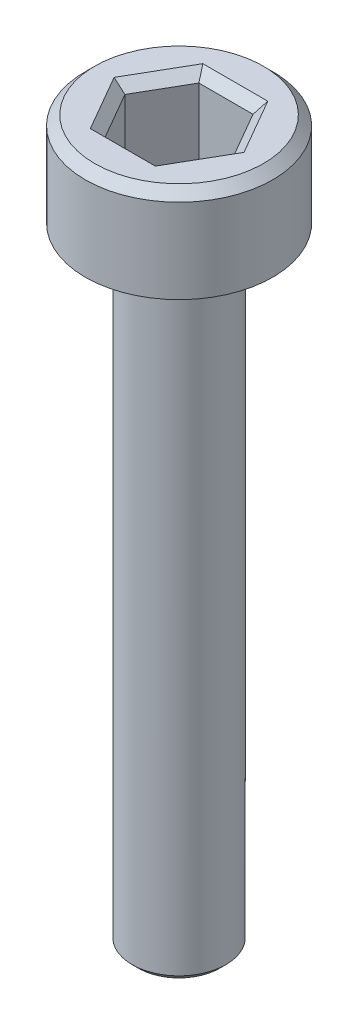
ISO-10303-21;
HEADER;
FILE_DESCRIPTION(('STEP AP214'),'2;1');
FILE_NAME('part.step','',(''),(''),'','','');
FILE_SCHEMA(('AUTOMOTIVE_DESIGN { 1 0 10303 214 1 1 1 1 }'));
ENDSEC;
DATA;
#1=APPLICATION_CONTEXT('core data for automotive mechanical design processes');
#2=APPLICATION_PROTOCOL_DEFINITION('international standard','automotive_design',2000,#1);
#3=PRODUCT_CONTEXT('',#1,'mechanical');
#4=PRODUCT('Part','Part','',(#3));
#5=PRODUCT_RELATED_PRODUCT_CATEGORY('part','',(#4));
#6=PRODUCT_DEFINITION_FORMATION('','',#4);
#7=PRODUCT_DEFINITION_CONTEXT('part definition',#1,'design');
#8=PRODUCT_DEFINITION('design','',#6,#7);
#9=PRODUCT_DEFINITION_SHAPE('','',#8);
#10=(LENGTH_UNIT() NAMED_UNIT(*) SI_UNIT(.MILLI.,.METRE.));
#11=(NAMED_UNIT(*) PLANE_ANGLE_UNIT() SI_UNIT($,.RADIAN.));
#12=(NAMED_UNIT(*) SI_UNIT($,.STERADIAN.) SOLID_ANGLE_UNIT());
#13=UNCERTAINTY_MEASURE_WITH_UNIT(LENGTH_MEASURE(1.E-05),#10,'distance_accuracy_value','');
#14=(GEOMETRIC_REPRESENTATION_CONTEXT(3) GLOBAL_UNCERTAINTY_ASSIGNED_CONTEXT((#13)) GLOBAL_UNIT_ASSIGNED_CONTEXT((#10,
#11,#12)) REPRESENTATION_CONTEXT('',''));
#15=CARTESIAN_POINT('',(0.,0.,0.));
#16=DIRECTION('',(0.,0.,1.));
#17=DIRECTION('',(1.,0.,0.));
#18=AXIS2_PLACEMENT_3D('',#15,#16,#17);
#19=CARTESIAN_POINT('',(0.,0.,0.));
#20=DIRECTION('',(0.,1.,0.));
#21=DIRECTION('',(0.,0.,1.));
#22=AXIS2_PLACEMENT_3D('',#19,#20,#21);
#23=PLANE('',#22);
#24=CARTESIAN_POINT('',(0.,0.,0.));
#25=DIRECTION('',(0.,1.,0.));
#26=DIRECTION('',(0.,0.,1.));
#27=AXIS2_PLACEMENT_3D('',#24,#25,#26);
#28=CIRCLE('',#27,3.);
#29=CARTESIAN_POINT('',(0.,0.,3.));
#30=VERTEX_POINT('',#29);
#31=EDGE_CURVE('E146',#30,#30,#28,.T.);
#32=ORIENTED_EDGE('',*,*,#31,.F.);
#33=EDGE_LOOP('',(#32));
#34=FACE_BOUND('',#33,.T.);
#35=CARTESIAN_POINT('',(0.,0.,0.));
#36=DIRECTION('',(0.,1.,0.));
#37=DIRECTION('',(0.,0.,1.));
#38=AXIS2_PLACEMENT_3D('',#35,#36,#37);
#39=CIRCLE('',#38,1.5);
#40=CARTESIAN_POINT('',(0.,0.,1.5));
#41=VERTEX_POINT('',#40);
#42=EDGE_CURVE('E185',#41,#41,#39,.F.);
#43=ORIENTED_EDGE('',*,*,#42,.F.);
#44=EDGE_LOOP('',(#43));
#45=FACE_BOUND('',#44,.T.);
#46=ADVANCED_FACE('F33',(#34,#45),#23,.F.);
#47=CARTESIAN_POINT('',(0.,3.,0.));
#48=DIRECTION('',(0.,-1.,0.));
#49=DIRECTION('',(0.,0.,-1.));
#50=AXIS2_PLACEMENT_3D('',#47,#48,#49);
#51=CYLINDRICAL_SURFACE('',#50,3.);
#52=CARTESIAN_POINT('',(0.,2.7,0.));
#53=DIRECTION('',(0.,1.,0.));
#54=DIRECTION('',(0.,0.,1.));
#55=AXIS2_PLACEMENT_3D('',#52,#53,#54);
#56=CIRCLE('',#55,3.);
#57=CARTESIAN_POINT('',(0.,2.7,3.));
#58=VERTEX_POINT('',#57);
#59=EDGE_CURVE('E160',#58,#58,#56,.F.);
#60=ORIENTED_EDGE('',*,*,#59,.T.);
#61=EDGE_LOOP('',(#60));
#62=FACE_BOUND('',#61,.T.);
#63=ORIENTED_EDGE('',*,*,#31,.T.);
#64=EDGE_LOOP('',(#63));
#65=FACE_BOUND('',#64,.T.);
#66=ADVANCED_FACE('F213',(#62,#65),#51,.T.);
#67=CARTESIAN_POINT('',(0.,3.,0.));
#68=DIRECTION('',(0.,1.,0.));
#69=DIRECTION('',(0.,0.,1.));
#70=AXIS2_PLACEMENT_3D('',#67,#68,#69);
#71=PLANE('',#70);
#72=DIRECTION('',(1.,0.,0.));
#73=VECTOR('',#72,1.);
#74=CARTESIAN_POINT('',(0.866025403784439,3.,-1.8));
#75=LINE('',#74,#73);
#76=CARTESIAN_POINT('',(-1.03923048454133,3.,-1.8));
#77=VERTEX_POINT('',#76);
#78=CARTESIAN_POINT('',(1.03923048454133,3.,-1.8));
#79=VERTEX_POINT('',#78);
#80=EDGE_CURVE('E165',#77,#79,#75,.T.);
#81=ORIENTED_EDGE('',*,*,#80,.T.);
#82=DIRECTION('',(0.5,0.,0.866025403784439));
#83=VECTOR('',#82,1.);
#84=CARTESIAN_POINT('',(1.99185842870421,3.,-0.150000000000001));
#85=LINE('',#84,#83);
#86=CARTESIAN_POINT('',(2.07846096908265,3.,0.));
#87=VERTEX_POINT('',#86);
#88=EDGE_CURVE('E175',#79,#87,#85,.T.);
#89=ORIENTED_EDGE('',*,*,#88,.T.);
#90=DIRECTION('',(-0.5,0.,0.866025403784439));
#91=VECTOR('',#90,1.);
#92=CARTESIAN_POINT('',(1.12583302491977,3.,1.65));
#93=LINE('',#92,#91);
#94=CARTESIAN_POINT('',(1.03923048454133,3.,1.8));
#95=VERTEX_POINT('',#94);
#96=EDGE_CURVE('E173',#87,#95,#93,.T.);
#97=ORIENTED_EDGE('',*,*,#96,.T.);
#98=DIRECTION('',(-1.,0.,0.));
#99=VECTOR('',#98,1.);
#100=CARTESIAN_POINT('',(-0.866025403784438,3.,1.8));
#101=LINE('',#100,#99);
#102=CARTESIAN_POINT('',(-1.03923048454133,3.,1.8));
#103=VERTEX_POINT('',#102);
#104=EDGE_CURVE('E171',#95,#103,#101,.T.);
#105=ORIENTED_EDGE('',*,*,#104,.T.);
#106=DIRECTION('',(-0.5,0.,-0.866025403784439));
#107=VECTOR('',#106,1.);
#108=CARTESIAN_POINT('',(-1.99185842870421,3.,0.150000000000001));
#109=LINE('',#108,#107);
#110=CARTESIAN_POINT('',(-2.07846096908265,3.,0.));
#111=VERTEX_POINT('',#110);
#112=EDGE_CURVE('E169',#103,#111,#109,.T.);
#113=ORIENTED_EDGE('',*,*,#112,.T.);
#114=DIRECTION('',(0.5,0.,-0.866025403784439));
#115=VECTOR('',#114,1.);
#116=CARTESIAN_POINT('',(-1.12583302491977,3.,-1.65));
#117=LINE('',#116,#115);
#118=EDGE_CURVE('E167',#111,#77,#117,.T.);
#119=ORIENTED_EDGE('',*,*,#118,.T.);
#120=EDGE_LOOP('',(#81,#89,#97,#105,#113,#119));
#121=FACE_BOUND('',#120,.T.);
#122=CARTESIAN_POINT('',(0.,3.,0.));
#123=DIRECTION('',(0.,1.,0.));
#124=DIRECTION('',(0.,0.,1.));
#125=AXIS2_PLACEMENT_3D('',#122,#123,#124);
#126=CIRCLE('',#125,2.7);
#127=CARTESIAN_POINT('',(0.,3.,2.7));
#128=VERTEX_POINT('',#127);
#129=EDGE_CURVE('E157',#128,#128,#126,.T.);
#130=ORIENTED_EDGE('',*,*,#129,.T.);
#131=EDGE_LOOP('',(#130));
#132=FACE_BOUND('',#131,.T.);
#133=ADVANCED_FACE('F219',(#121,#132),#71,.T.);
#134=CARTESIAN_POINT('',(0.,3.,0.));
#135=DIRECTION('',(0.,-1.,0.));
#136=DIRECTION('',(0.,0.,-1.));
#137=AXIS2_PLACEMENT_3D('',#134,#135,#136);
#138=CONICAL_SURFACE('',#137,2.7,0.785398163397448);
#139=ORIENTED_EDGE('',*,*,#59,.F.);
#140=EDGE_LOOP('',(#139));
#141=FACE_BOUND('',#140,.T.);
#142=ORIENTED_EDGE('',*,*,#129,.F.);
#143=EDGE_LOOP('',(#142));
#144=FACE_BOUND('',#143,.T.);
#145=ADVANCED_FACE('F227',(#141,#144),#138,.T.);
#146=CARTESIAN_POINT('',(0.866025403784439,0.5,1.5));
#147=DIRECTION('',(0.866025403784439,0.,0.5));
#148=DIRECTION('',(0.5,0.,-0.866025403784439));
#149=AXIS2_PLACEMENT_3D('',#146,#147,#148);
#150=PLANE('',#149);
#151=DIRECTION('',(0.,1.,0.));
#152=VECTOR('',#151,1.);
#153=CARTESIAN_POINT('',(0.866025403784439,0.5,1.5));
#154=LINE('',#153,#152);
#155=CARTESIAN_POINT('',(0.866025403784439,0.5,1.5));
#156=VERTEX_POINT('',#155);
#157=CARTESIAN_POINT('',(0.866025403784439,2.7,1.5));
#158=VERTEX_POINT('',#157);
#159=EDGE_CURVE('E144',#156,#158,#154,.T.);
#160=ORIENTED_EDGE('',*,*,#159,.T.);
#161=DIRECTION('',(0.5,0.,-0.866025403784439));
#162=VECTOR('',#161,1.);
#163=CARTESIAN_POINT('',(1.73205080756888,2.7,0.));
#164=LINE('',#163,#162);
#165=CARTESIAN_POINT('',(1.73205080756888,2.7,0.));
#166=VERTEX_POINT('',#165);
#167=EDGE_CURVE('E113',#158,#166,#164,.T.);
#168=ORIENTED_EDGE('',*,*,#167,.T.);
#169=DIRECTION('',(0.,1.,0.));
#170=VECTOR('',#169,1.);
#171=CARTESIAN_POINT('',(1.73205080756888,0.5,0.));
#172=LINE('',#171,#170);
#173=CARTESIAN_POINT('',(1.73205080756888,0.5,0.));
#174=VERTEX_POINT('',#173);
#175=EDGE_CURVE('E105',#174,#166,#172,.T.);
#176=ORIENTED_EDGE('',*,*,#175,.F.);
#177=DIRECTION('',(0.5,0.,-0.866025403784439));
#178=VECTOR('',#177,1.);
#179=CARTESIAN_POINT('',(0.866025403784439,0.5,1.5));
#180=LINE('',#179,#178);
#181=EDGE_CURVE('E110',#156,#174,#180,.T.);
#182=ORIENTED_EDGE('',*,*,#181,.F.);
#183=EDGE_LOOP('',(#160,#168,#176,#182));
#184=FACE_BOUND('',#183,.T.);
#185=ADVANCED_FACE('F108',(#184),#150,.F.);
#186=CARTESIAN_POINT('',(-0.866025403784438,0.5,1.5));
#187=DIRECTION('',(0.,0.,1.));
#188=DIRECTION('',(1.,0.,0.));
#189=AXIS2_PLACEMENT_3D('',#186,#187,#188);
#190=PLANE('',#189);
#191=DIRECTION('',(0.,1.,0.));
#192=VECTOR('',#191,1.);
#193=CARTESIAN_POINT('',(-0.866025403784438,0.5,1.5));
#194=LINE('',#193,#192);
#195=CARTESIAN_POINT('',(-0.866025403784438,0.5,1.5));
#196=VERTEX_POINT('',#195);
#197=CARTESIAN_POINT('',(-0.866025403784438,2.7,1.5));
#198=VERTEX_POINT('',#197);
#199=EDGE_CURVE('E147',#196,#198,#194,.T.);
#200=ORIENTED_EDGE('',*,*,#199,.T.);
#201=DIRECTION('',(1.,0.,0.));
#202=VECTOR('',#201,1.);
#203=CARTESIAN_POINT('',(0.866025403784439,2.7,1.5));
#204=LINE('',#203,#202);
#205=EDGE_CURVE('E179',#198,#158,#204,.T.);
#206=ORIENTED_EDGE('',*,*,#205,.T.);
#207=ORIENTED_EDGE('',*,*,#159,.F.);
#208=DIRECTION('',(1.,0.,0.));
#209=VECTOR('',#208,1.);
#210=CARTESIAN_POINT('',(-0.866025403784438,0.5,1.5));
#211=LINE('',#210,#209);
#212=EDGE_CURVE('E118',#196,#156,#211,.T.);
#213=ORIENTED_EDGE('',*,*,#212,.F.);
#214=EDGE_LOOP('',(#200,#206,#207,#213));
#215=FACE_BOUND('',#214,.T.);
#216=ADVANCED_FACE('F280',(#215),#190,.F.);
#217=CARTESIAN_POINT('',(-1.73205080756888,0.5,0.));
#218=DIRECTION('',(-0.866025403784438,0.,0.5));
#219=DIRECTION('',(0.5,0.,0.866025403784439));
#220=AXIS2_PLACEMENT_3D('',#217,#218,#219);
#221=PLANE('',#220);
#222=DIRECTION('',(0.,1.,0.));
#223=VECTOR('',#222,1.);
#224=CARTESIAN_POINT('',(-1.73205080756888,0.5,0.));
#225=LINE('',#224,#223);
#226=CARTESIAN_POINT('',(-1.73205080756888,0.5,0.));
#227=VERTEX_POINT('',#226);
#228=CARTESIAN_POINT('',(-1.73205080756888,2.7,0.));
#229=VERTEX_POINT('',#228);
#230=EDGE_CURVE('E150',#227,#229,#225,.T.);
#231=ORIENTED_EDGE('',*,*,#230,.T.);
#232=DIRECTION('',(0.5,0.,0.866025403784439));
#233=VECTOR('',#232,1.);
#234=CARTESIAN_POINT('',(-0.866025403784438,2.7,1.5));
#235=LINE('',#234,#233);
#236=EDGE_CURVE('E181',#229,#198,#235,.T.);
#237=ORIENTED_EDGE('',*,*,#236,.T.);
#238=ORIENTED_EDGE('',*,*,#199,.F.);
#239=DIRECTION('',(0.5,0.,0.866025403784439));
#240=VECTOR('',#239,1.);
#241=CARTESIAN_POINT('',(-1.73205080756888,0.5,0.));
#242=LINE('',#241,#240);
#243=EDGE_CURVE('E141',#227,#196,#242,.T.);
#244=ORIENTED_EDGE('',*,*,#243,.F.);
#245=EDGE_LOOP('',(#231,#237,#238,#244));
#246=FACE_BOUND('',#245,.T.);
#247=ADVANCED_FACE('F278',(#246),#221,.F.);
#248=CARTESIAN_POINT('',(-0.866025403784438,0.5,-1.5));
#249=DIRECTION('',(-0.866025403784439,0.,-0.5));
#250=DIRECTION('',(-0.5,0.,0.866025403784439));
#251=AXIS2_PLACEMENT_3D('',#248,#249,#250);
#252=PLANE('',#251);
#253=DIRECTION('',(0.,1.,0.));
#254=VECTOR('',#253,1.);
#255=CARTESIAN_POINT('',(-0.866025403784438,0.5,-1.5));
#256=LINE('',#255,#254);
#257=CARTESIAN_POINT('',(-0.866025403784438,0.5,-1.5));
#258=VERTEX_POINT('',#257);
#259=CARTESIAN_POINT('',(-0.866025403784438,2.7,-1.5));
#260=VERTEX_POINT('',#259);
#261=EDGE_CURVE('E152',#258,#260,#256,.T.);
#262=ORIENTED_EDGE('',*,*,#261,.T.);
#263=DIRECTION('',(-0.5,0.,0.866025403784439));
#264=VECTOR('',#263,1.);
#265=CARTESIAN_POINT('',(-1.73205080756888,2.7,0.));
#266=LINE('',#265,#264);
#267=EDGE_CURVE('E55',#260,#229,#266,.T.);
#268=ORIENTED_EDGE('',*,*,#267,.T.);
#269=ORIENTED_EDGE('',*,*,#230,.F.);
#270=DIRECTION('',(-0.5,0.,0.866025403784439));
#271=VECTOR('',#270,1.);
#272=CARTESIAN_POINT('',(-0.866025403784438,0.5,-1.5));
#273=LINE('',#272,#271);
#274=EDGE_CURVE('E138',#258,#227,#273,.T.);
#275=ORIENTED_EDGE('',*,*,#274,.F.);
#276=EDGE_LOOP('',(#262,#268,#269,#275));
#277=FACE_BOUND('',#276,.T.);
#278=ADVANCED_FACE('F276',(#277),#252,.F.);
#279=CARTESIAN_POINT('',(0.866025403784439,0.5,-1.5));
#280=DIRECTION('',(0.,0.,-1.));
#281=DIRECTION('',(-1.,0.,0.));
#282=AXIS2_PLACEMENT_3D('',#279,#280,#281);
#283=PLANE('',#282);
#284=DIRECTION('',(0.,1.,0.));
#285=VECTOR('',#284,1.);
#286=CARTESIAN_POINT('',(0.866025403784439,0.5,-1.5));
#287=LINE('',#286,#285);
#288=CARTESIAN_POINT('',(0.866025403784439,0.5,-1.5));
#289=VERTEX_POINT('',#288);
#290=CARTESIAN_POINT('',(0.866025403784439,2.7,-1.5));
#291=VERTEX_POINT('',#290);
#292=EDGE_CURVE('E117',#289,#291,#287,.T.);
#293=ORIENTED_EDGE('',*,*,#292,.T.);
#294=DIRECTION('',(-1.,0.,0.));
#295=VECTOR('',#294,1.);
#296=CARTESIAN_POINT('',(-0.866025403784438,2.7,-1.5));
#297=LINE('',#296,#295);
#298=EDGE_CURVE('E48',#291,#260,#297,.T.);
#299=ORIENTED_EDGE('',*,*,#298,.T.);
#300=ORIENTED_EDGE('',*,*,#261,.F.);
#301=DIRECTION('',(-1.,0.,0.));
#302=VECTOR('',#301,1.);
#303=CARTESIAN_POINT('',(0.866025403784439,0.5,-1.5));
#304=LINE('',#303,#302);
#305=EDGE_CURVE('E126',#289,#258,#304,.T.);
#306=ORIENTED_EDGE('',*,*,#305,.F.);
#307=EDGE_LOOP('',(#293,#299,#300,#306));
#308=FACE_BOUND('',#307,.T.);
#309=ADVANCED_FACE('F273',(#308),#283,.F.);
#310=CARTESIAN_POINT('',(1.73205080756888,0.5,0.));
#311=DIRECTION('',(0.866025403784438,0.,-0.5));
#312=DIRECTION('',(-0.5,0.,-0.866025403784438));
#313=AXIS2_PLACEMENT_3D('',#310,#311,#312);
#314=PLANE('',#313);
#315=ORIENTED_EDGE('',*,*,#175,.T.);
#316=DIRECTION('',(-0.5,0.,-0.866025403784438));
#317=VECTOR('',#316,1.);
#318=CARTESIAN_POINT('',(0.866025403784439,2.7,-1.5));
#319=LINE('',#318,#317);
#320=EDGE_CURVE('E163',#166,#291,#319,.T.);
#321=ORIENTED_EDGE('',*,*,#320,.T.);
#322=ORIENTED_EDGE('',*,*,#292,.F.);
#323=DIRECTION('',(-0.5,0.,-0.866025403784438));
#324=VECTOR('',#323,1.);
#325=CARTESIAN_POINT('',(1.73205080756888,0.5,0.));
#326=LINE('',#325,#324);
#327=EDGE_CURVE('E121',#174,#289,#326,.T.);
#328=ORIENTED_EDGE('',*,*,#327,.F.);
#329=EDGE_LOOP('',(#315,#321,#322,#328));
#330=FACE_BOUND('',#329,.T.);
#331=ADVANCED_FACE('F122',(#330),#314,.F.);
#332=CARTESIAN_POINT('',(0.,0.5,0.));
#333=DIRECTION('',(0.,1.,0.));
#334=DIRECTION('',(0.,0.,1.));
#335=AXIS2_PLACEMENT_3D('',#332,#333,#334);
#336=PLANE('',#335);
#337=ORIENTED_EDGE('',*,*,#181,.T.);
#338=ORIENTED_EDGE('',*,*,#327,.T.);
#339=ORIENTED_EDGE('',*,*,#305,.T.);
#340=ORIENTED_EDGE('',*,*,#274,.T.);
#341=ORIENTED_EDGE('',*,*,#243,.T.);
#342=ORIENTED_EDGE('',*,*,#212,.T.);
#343=EDGE_LOOP('',(#337,#338,#339,#340,#341,#342));
#344=FACE_BOUND('',#343,.T.);
#345=ADVANCED_FACE('F128',(#344),#336,.T.);
#346=CARTESIAN_POINT('',(-1.73205080756888,2.7,0.));
#347=DIRECTION('',(0.612372435695794,0.707106781186548,-0.353553390593273));
#348=DIRECTION('',(-0.5,0.,-0.866025403784439));
#349=AXIS2_PLACEMENT_3D('',#346,#347,#348);
#350=PLANE('',#349);
#351=DIRECTION('',(0.755928946018455,-0.654653670707976,0.));
#352=VECTOR('',#351,1.);
#353=CARTESIAN_POINT('',(-1.73205080756888,2.7,0.));
#354=LINE('',#353,#352);
#355=EDGE_CURVE('E134',#111,#229,#354,.T.);
#356=ORIENTED_EDGE('',*,*,#355,.F.);
#357=ORIENTED_EDGE('',*,*,#112,.F.);
#358=DIRECTION('',(0.377964473009228,-0.654653670707976,-0.654653670707978));
#359=VECTOR('',#358,1.);
#360=CARTESIAN_POINT('',(-0.866025403784438,2.7,1.5));
#361=LINE('',#360,#359);
#362=EDGE_CURVE('E131',#198,#103,#361,.F.);
#363=ORIENTED_EDGE('',*,*,#362,.F.);
#364=ORIENTED_EDGE('',*,*,#236,.F.);
#365=EDGE_LOOP('',(#356,#357,#363,#364));
#366=FACE_BOUND('',#365,.T.);
#367=ADVANCED_FACE('F249',(#366),#350,.T.);
#368=CARTESIAN_POINT('',(-0.866025403784438,2.7,1.5));
#369=DIRECTION('',(0.,0.707106781186548,-0.707106781186547));
#370=DIRECTION('',(-1.,0.,0.));
#371=AXIS2_PLACEMENT_3D('',#368,#369,#370);
#372=PLANE('',#371);
#373=ORIENTED_EDGE('',*,*,#362,.T.);
#374=ORIENTED_EDGE('',*,*,#104,.F.);
#375=DIRECTION('',(-0.377964473009228,-0.654653670707976,-0.654653670707978));
#376=VECTOR('',#375,1.);
#377=CARTESIAN_POINT('',(0.866025403784439,2.7,1.5));
#378=LINE('',#377,#376);
#379=EDGE_CURVE('E193',#158,#95,#378,.F.);
#380=ORIENTED_EDGE('',*,*,#379,.F.);
#381=ORIENTED_EDGE('',*,*,#205,.F.);
#382=EDGE_LOOP('',(#373,#374,#380,#381));
#383=FACE_BOUND('',#382,.T.);
#384=ADVANCED_FACE('F246',(#383),#372,.T.);
#385=CARTESIAN_POINT('',(-0.866025403784438,2.7,-1.5));
#386=DIRECTION('',(0.612372435695794,0.707106781186549,0.353553390593273));
#387=DIRECTION('',(0.5,0.,-0.866025403784439));
#388=AXIS2_PLACEMENT_3D('',#385,#386,#387);
#389=PLANE('',#388);
#390=ORIENTED_EDGE('',*,*,#355,.T.);
#391=ORIENTED_EDGE('',*,*,#267,.F.);
#392=DIRECTION('',(0.377964473009228,-0.654653670707976,0.654653670707978));
#393=VECTOR('',#392,1.);
#394=CARTESIAN_POINT('',(-0.866025403784438,2.7,-1.5));
#395=LINE('',#394,#393);
#396=EDGE_CURVE('E190',#77,#260,#395,.T.);
#397=ORIENTED_EDGE('',*,*,#396,.F.);
#398=ORIENTED_EDGE('',*,*,#118,.F.);
#399=EDGE_LOOP('',(#390,#391,#397,#398));
#400=FACE_BOUND('',#399,.T.);
#401=ADVANCED_FACE('F242',(#400),#389,.T.);
#402=CARTESIAN_POINT('',(0.866025403784439,2.7,1.5));
#403=DIRECTION('',(-0.612372435695794,0.707106781186549,-0.353553390593273));
#404=DIRECTION('',(-0.5,0.,0.866025403784439));
#405=AXIS2_PLACEMENT_3D('',#402,#403,#404);
#406=PLANE('',#405);
#407=ORIENTED_EDGE('',*,*,#379,.T.);
#408=ORIENTED_EDGE('',*,*,#96,.F.);
#409=DIRECTION('',(-0.755928946018455,-0.654653670707976,0.));
#410=VECTOR('',#409,1.);
#411=CARTESIAN_POINT('',(1.73205080756888,2.7,0.));
#412=LINE('',#411,#410);
#413=EDGE_CURVE('E188',#166,#87,#412,.F.);
#414=ORIENTED_EDGE('',*,*,#413,.F.);
#415=ORIENTED_EDGE('',*,*,#167,.F.);
#416=EDGE_LOOP('',(#407,#408,#414,#415));
#417=FACE_BOUND('',#416,.T.);
#418=ADVANCED_FACE('F238',(#417),#406,.T.);
#419=CARTESIAN_POINT('',(0.866025403784439,2.7,-1.5));
#420=DIRECTION('',(0.,0.707106781186549,0.707106781186547));
#421=DIRECTION('',(1.,0.,0.));
#422=AXIS2_PLACEMENT_3D('',#419,#420,#421);
#423=PLANE('',#422);
#424=ORIENTED_EDGE('',*,*,#396,.T.);
#425=ORIENTED_EDGE('',*,*,#298,.F.);
#426=DIRECTION('',(0.377964473009228,0.654653670707976,-0.654653670707978));
#427=VECTOR('',#426,1.);
#428=CARTESIAN_POINT('',(0.618589574131741,2.27142857142857,-1.07142857142857));
#429=LINE('',#428,#427);
#430=EDGE_CURVE('E186',#79,#291,#429,.F.);
#431=ORIENTED_EDGE('',*,*,#430,.F.);
#432=ORIENTED_EDGE('',*,*,#80,.F.);
#433=EDGE_LOOP('',(#424,#425,#431,#432));
#434=FACE_BOUND('',#433,.T.);
#435=ADVANCED_FACE('F234',(#434),#423,.T.);
#436=CARTESIAN_POINT('',(1.73205080756888,2.7,0.));
#437=DIRECTION('',(-0.612372435695793,0.707106781186549,0.353553390593273));
#438=DIRECTION('',(0.5,0.,0.866025403784438));
#439=AXIS2_PLACEMENT_3D('',#436,#437,#438);
#440=PLANE('',#439);
#441=ORIENTED_EDGE('',*,*,#413,.T.);
#442=ORIENTED_EDGE('',*,*,#88,.F.);
#443=ORIENTED_EDGE('',*,*,#430,.T.);
#444=ORIENTED_EDGE('',*,*,#320,.F.);
#445=EDGE_LOOP('',(#441,#442,#443,#444));
#446=FACE_BOUND('',#445,.T.);
#447=ADVANCED_FACE('F231',(#446),#440,.T.);
#448=CARTESIAN_POINT('',(0.,-20.,0.));
#449=DIRECTION('',(0.,1.,0.));
#450=DIRECTION('',(0.,0.,1.));
#451=AXIS2_PLACEMENT_3D('',#448,#449,#450);
#452=CYLINDRICAL_SURFACE('',#451,1.5);
#453=CARTESIAN_POINT('',(0.,-19.8,0.));
#454=DIRECTION('',(0.,-1.,0.));
#455=DIRECTION('',(0.,0.,-1.));
#456=AXIS2_PLACEMENT_3D('',#453,#454,#455);
#457=CIRCLE('',#456,1.5);
#458=CARTESIAN_POINT('',(0.,-19.8,-1.5));
#459=VERTEX_POINT('',#458);
#460=EDGE_CURVE('E11',#459,#459,#457,.F.);
#461=ORIENTED_EDGE('',*,*,#460,.T.);
#462=EDGE_LOOP('',(#461));
#463=FACE_BOUND('',#462,.T.);
#464=ORIENTED_EDGE('',*,*,#42,.T.);
#465=EDGE_LOOP('',(#464));
#466=FACE_BOUND('',#465,.T.);
#467=ADVANCED_FACE('F209',(#463,#466),#452,.T.);
#468=CARTESIAN_POINT('',(0.,-20.,0.));
#469=DIRECTION('',(0.,-1.,0.));
#470=DIRECTION('',(0.,0.,-1.));
#471=AXIS2_PLACEMENT_3D('',#468,#469,#470);
#472=PLANE('',#471);
#473=CARTESIAN_POINT('',(0.,-20.,0.));
#474=DIRECTION('',(0.,-1.,0.));
#475=DIRECTION('',(0.,0.,-1.));
#476=AXIS2_PLACEMENT_3D('',#473,#474,#475);
#477=CIRCLE('',#476,1.3);
#478=CARTESIAN_POINT('',(0.,-20.,-1.3));
#479=VERTEX_POINT('',#478);
#480=EDGE_CURVE('E41',#479,#479,#477,.T.);
#481=ORIENTED_EDGE('',*,*,#480,.T.);
#482=EDGE_LOOP('',(#481));
#483=FACE_BOUND('',#482,.T.);
#484=ADVANCED_FACE('F202',(#483),#472,.T.);
#485=CARTESIAN_POINT('',(0.,-20.,0.));
#486=DIRECTION('',(0.,1.,0.));
#487=DIRECTION('',(0.,0.,1.));
#488=AXIS2_PLACEMENT_3D('',#485,#486,#487);
#489=CONICAL_SURFACE('',#488,1.3,0.785398163397446);
#490=ORIENTED_EDGE('',*,*,#460,.F.);
#491=EDGE_LOOP('',(#490));
#492=FACE_BOUND('',#491,.T.);
#493=ORIENTED_EDGE('',*,*,#480,.F.);
#494=EDGE_LOOP('',(#493));
#495=FACE_BOUND('',#494,.T.);
#496=ADVANCED_FACE('F35',(#492,#495),#489,.T.);
#497=CLOSED_SHELL('',(#46,#66,#133,#145,#185,#216,#247,#278,#309,#331,#345,#367,#384,#401,#418,
#435,#447,#467,#484,#496));
#498=MANIFOLD_SOLID_BREP('B2',#497);
#499=ADVANCED_BREP_SHAPE_REPRESENTATION('',(#18,#498),#14);
#500=SHAPE_DEFINITION_REPRESENTATION(#9,#499);
ENDSEC;
END-ISO-10303-21;
